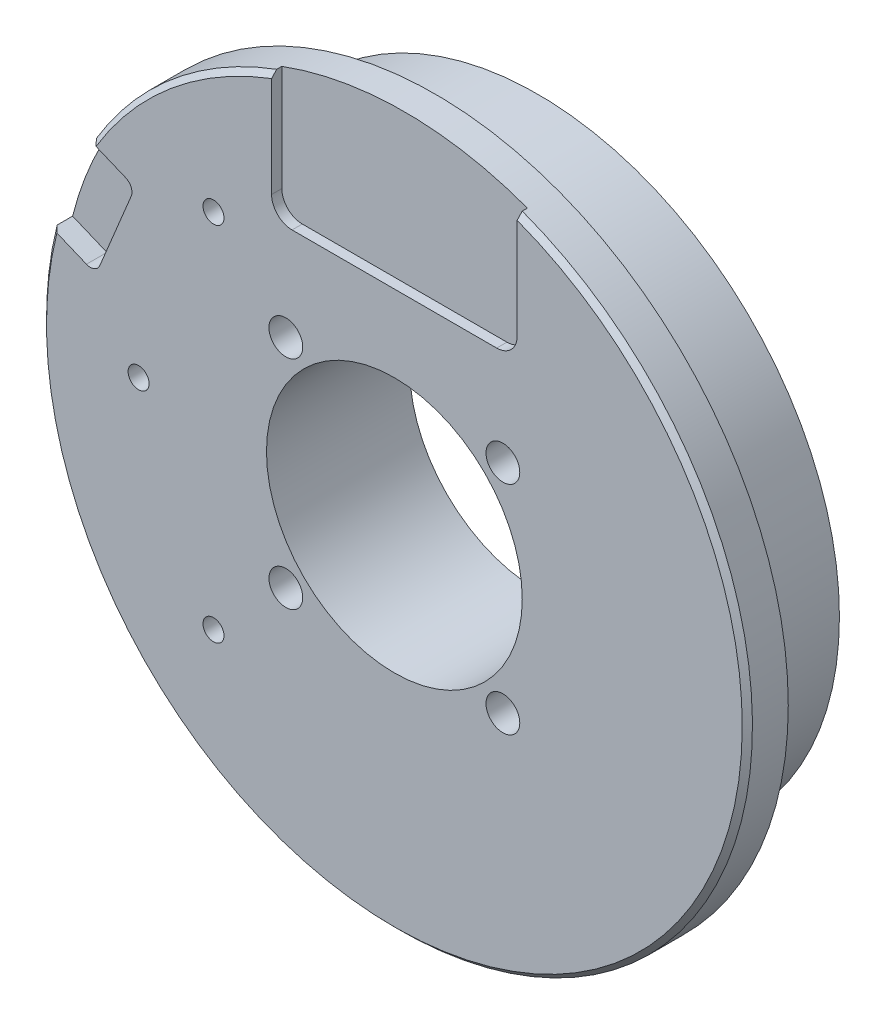
ISO-10303-21;
HEADER;
FILE_DESCRIPTION(('STEP AP214'),'2;1');
FILE_NAME('part.step','',(''),(''),'','','');
FILE_SCHEMA(('AUTOMOTIVE_DESIGN { 1 0 10303 214 1 1 1 1 }'));
ENDSEC;
DATA;
#1=APPLICATION_CONTEXT('core data for automotive mechanical design processes');
#2=APPLICATION_PROTOCOL_DEFINITION('international standard','automotive_design',2000,#1);
#3=PRODUCT_CONTEXT('',#1,'mechanical');
#4=PRODUCT('Part','Part','',(#3));
#5=PRODUCT_RELATED_PRODUCT_CATEGORY('part','',(#4));
#6=PRODUCT_DEFINITION_FORMATION('','',#4);
#7=PRODUCT_DEFINITION_CONTEXT('part definition',#1,'design');
#8=PRODUCT_DEFINITION('design','',#6,#7);
#9=PRODUCT_DEFINITION_SHAPE('','',#8);
#10=(LENGTH_UNIT() NAMED_UNIT(*) SI_UNIT(.MILLI.,.METRE.));
#11=(NAMED_UNIT(*) PLANE_ANGLE_UNIT() SI_UNIT($,.RADIAN.));
#12=(NAMED_UNIT(*) SI_UNIT($,.STERADIAN.) SOLID_ANGLE_UNIT());
#13=UNCERTAINTY_MEASURE_WITH_UNIT(LENGTH_MEASURE(1.E-05),#10,'distance_accuracy_value','');
#14=(GEOMETRIC_REPRESENTATION_CONTEXT(3) GLOBAL_UNCERTAINTY_ASSIGNED_CONTEXT((#13)) GLOBAL_UNIT_ASSIGNED_CONTEXT((#10,
#11,#12)) REPRESENTATION_CONTEXT('',''));
#15=CARTESIAN_POINT('',(0.,0.,0.));
#16=DIRECTION('',(0.,0.,1.));
#17=DIRECTION('',(1.,0.,0.));
#18=AXIS2_PLACEMENT_3D('',#15,#16,#17);
#19=CARTESIAN_POINT('',(0.,0.,14.));
#20=DIRECTION('',(0.,0.,-1.));
#21=DIRECTION('',(-1.,0.,0.));
#22=AXIS2_PLACEMENT_3D('',#19,#20,#21);
#23=CONICAL_SURFACE('',#22,34.,0.785398163397455);
#24=CARTESIAN_POINT('',(12.,20.3701050144087,24.3580631441067));
#25=CARTESIAN_POINT('',(12.,20.8510257641499,23.9436532870949));
#26=CARTESIAN_POINT('',(12.,21.3301158373592,23.5271292527835));
#27=CARTESIAN_POINT('',(12.,22.2851127258477,22.6904625830068));
#28=CARTESIAN_POINT('',(12.,22.761019595021,22.2703200090831));
#29=CARTESIAN_POINT('',(12.,23.7101150898162,21.4270380033852));
#30=CARTESIAN_POINT('',(12.,24.1833038818656,21.0038987587169));
#31=CARTESIAN_POINT('',(12.,25.1273642857462,20.1550400267585));
#32=CARTESIAN_POINT('',(12.,25.5982358862306,19.7293205268561));
#33=CARTESIAN_POINT('',(12.,27.007704540796,18.44900624832));
#34=CARTESIAN_POINT('',(12.,27.9433100887828,17.5911178367607));
#35=CARTESIAN_POINT('',(12.,29.8084621001592,15.8687575159984));
#36=CARTESIAN_POINT('',(12.,30.7380084504316,15.0042854845375));
#37=CARTESIAN_POINT('',(12.,32.5922293768415,13.2703941157218));
#38=CARTESIAN_POINT('',(12.,33.5169046145411,12.4009754853828));
#39=CARTESIAN_POINT('',(12.,35.3624825515551,10.658158216124));
#40=CARTESIAN_POINT('',(12.,36.283385275592,9.78475960336574));
#41=CARTESIAN_POINT('',(12.,38.122301169529,8.03464065922348));
#42=CARTESIAN_POINT('',(12.,39.0403138659242,7.15791983059604));
#43=CARTESIAN_POINT('',(12.,40.8738318333564,5.40185795707337));
#44=CARTESIAN_POINT('',(12.,41.7893371021223,4.5225169098064));
#45=CARTESIAN_POINT('',(12.,42.7038511233784,3.64214950239749));
#46=B_SPLINE_CURVE_WITH_KNOTS('',3,(#24,#25,#26,#27,#28,#29,#30,#31,#32,#33,#34,#35,#36,#37,#38,
#39,#40,#41,#42,#43,#44,#45),.UNSPECIFIED.,.F.,.F.,(4,2,2,2,2,2,2,2,2,2,4),(0.,1.90450046408245,
3.8089686014117,5.71331885815735,7.61767843096836,11.425776107933,15.2339446746117,
19.0415819696277,22.8491942718828,26.6574009491694,30.4656110745797),.UNSPECIFIED.);
#47=CARTESIAN_POINT('',(12.,31.8119474411737,14.));
#48=VERTEX_POINT('',#47);
#49=CARTESIAN_POINT('',(12.,32.3457879792717,13.5));
#50=VERTEX_POINT('',#49);
#51=EDGE_CURVE('E11',#48,#50,#46,.T.);
#52=ORIENTED_EDGE('',*,*,#51,.F.);
#53=CARTESIAN_POINT('',(0.,0.,14.));
#54=DIRECTION('',(0.,0.,1.));
#55=DIRECTION('',(1.,0.,0.));
#56=AXIS2_PLACEMENT_3D('',#53,#54,#55);
#57=CIRCLE('',#56,34.);
#58=CARTESIAN_POINT('',(-32.9838031388453,8.25037759729192,14.));
#59=VERTEX_POINT('',#58);
#60=EDGE_CURVE('E338',#59,#48,#57,.T.);
#61=ORIENTED_EDGE('',*,*,#60,.F.);
#62=CARTESIAN_POINT('',(-33.4509324009775,8.44386887304839,13.4998));
#63=CARTESIAN_POINT('',(-33.3730525179315,8.41160996925473,13.5832067052391));
#64=CARTESIAN_POINT('',(-33.2951695706538,8.37934979621471,13.6666100578582));
#65=CARTESIAN_POINT('',(-33.1393975476329,8.31482691164117,13.8334100578582));
#66=CARTESIAN_POINT('',(-33.0615084718898,8.28256420010765,13.9168067052391));
#67=CARTESIAN_POINT('',(-32.9836163319148,8.25030021932777,14.0002));
#68=B_SPLINE_CURVE_WITH_KNOTS('',3,(#62,#63,#64,#65,#66,#67),.UNSPECIFIED.,.F.,.F.,(4,2,4),(0.,
0.355757393772891,0.711514787553999),.UNSPECIFIED.);
#69=CARTESIAN_POINT('',(-33.4507456534528,8.44379151969096,13.5));
#70=VERTEX_POINT('',#69);
#71=EDGE_CURVE('E344',#70,#59,#68,.T.);
#72=ORIENTED_EDGE('',*,*,#71,.F.);
#73=CARTESIAN_POINT('',(0.,0.,13.5));
#74=DIRECTION('',(0.,0.,1.));
#75=DIRECTION('',(1.,0.,0.));
#76=AXIS2_PLACEMENT_3D('',#73,#74,#75);
#77=CIRCLE('',#76,34.5);
#78=EDGE_CURVE('E75',#50,#70,#77,.F.);
#79=ORIENTED_EDGE('',*,*,#78,.F.);
#80=EDGE_LOOP('',(#52,#61,#72,#79));
#81=FACE_BOUND('',#80,.T.);
#82=ADVANCED_FACE('F45',(#81),#23,.T.);
#83=CARTESIAN_POINT('',(0.,0.,10.));
#84=DIRECTION('',(0.,0.,-1.));
#85=DIRECTION('',(-1.,0.,0.));
#86=AXIS2_PLACEMENT_3D('',#83,#84,#85);
#87=CYLINDRICAL_SURFACE('',#86,29.5);
#88=CARTESIAN_POINT('',(0.,0.,10.));
#89=DIRECTION('',(0.,0.,1.));
#90=DIRECTION('',(1.,0.,0.));
#91=AXIS2_PLACEMENT_3D('',#88,#89,#90);
#92=CIRCLE('',#91,29.5);
#93=CARTESIAN_POINT('',(29.5,0.,10.));
#94=VERTEX_POINT('',#93);
#95=EDGE_CURVE('E330',#94,#94,#92,.T.);
#96=ORIENTED_EDGE('',*,*,#95,.F.);
#97=EDGE_LOOP('',(#96));
#98=FACE_BOUND('',#97,.T.);
#99=CARTESIAN_POINT('',(0.,0.,0.));
#100=DIRECTION('',(0.,0.,1.));
#101=DIRECTION('',(1.,0.,0.));
#102=AXIS2_PLACEMENT_3D('',#99,#100,#101);
#103=CIRCLE('',#102,29.5);
#104=CARTESIAN_POINT('',(29.5,0.,0.));
#105=VERTEX_POINT('',#104);
#106=EDGE_CURVE('E329',#105,#105,#103,.T.);
#107=ORIENTED_EDGE('',*,*,#106,.T.);
#108=EDGE_LOOP('',(#107));
#109=FACE_BOUND('',#108,.T.);
#110=ADVANCED_FACE('F423',(#98,#109),#87,.T.);
#111=CARTESIAN_POINT('',(0.,0.,0.));
#112=DIRECTION('',(0.,0.,1.));
#113=DIRECTION('',(1.,0.,0.));
#114=AXIS2_PLACEMENT_3D('',#111,#112,#113);
#115=PLANE('',#114);
#116=CARTESIAN_POINT('',(-10.6066017177982,10.6066017177982,0.));
#117=DIRECTION('',(0.,0.,1.));
#118=DIRECTION('',(1.,0.,0.));
#119=AXIS2_PLACEMENT_3D('',#116,#117,#118);
#120=CIRCLE('',#119,1.65);
#121=CARTESIAN_POINT('',(-8.95660171779821,10.6066017177982,0.));
#122=VERTEX_POINT('',#121);
#123=EDGE_CURVE('E289',#122,#122,#120,.T.);
#124=ORIENTED_EDGE('',*,*,#123,.T.);
#125=EDGE_LOOP('',(#124));
#126=FACE_BOUND('',#125,.T.);
#127=CARTESIAN_POINT('',(10.6066017177982,10.6066017177982,0.));
#128=DIRECTION('',(0.,0.,1.));
#129=DIRECTION('',(1.,0.,0.));
#130=AXIS2_PLACEMENT_3D('',#127,#128,#129);
#131=CIRCLE('',#130,1.65);
#132=CARTESIAN_POINT('',(12.2566017177982,10.6066017177982,0.));
#133=VERTEX_POINT('',#132);
#134=EDGE_CURVE('E297',#133,#133,#131,.T.);
#135=ORIENTED_EDGE('',*,*,#134,.T.);
#136=EDGE_LOOP('',(#135));
#137=FACE_BOUND('',#136,.T.);
#138=CARTESIAN_POINT('',(10.6066017177982,-10.6066017177982,0.));
#139=DIRECTION('',(0.,0.,1.));
#140=DIRECTION('',(1.,0.,0.));
#141=AXIS2_PLACEMENT_3D('',#138,#139,#140);
#142=CIRCLE('',#141,1.65);
#143=CARTESIAN_POINT('',(12.2566017177982,-10.6066017177982,0.));
#144=VERTEX_POINT('',#143);
#145=EDGE_CURVE('E305',#144,#144,#142,.T.);
#146=ORIENTED_EDGE('',*,*,#145,.T.);
#147=EDGE_LOOP('',(#146));
#148=FACE_BOUND('',#147,.T.);
#149=CARTESIAN_POINT('',(-10.6066017177982,-10.6066017177982,0.));
#150=DIRECTION('',(0.,0.,1.));
#151=DIRECTION('',(1.,0.,0.));
#152=AXIS2_PLACEMENT_3D('',#149,#150,#151);
#153=CIRCLE('',#152,1.65);
#154=CARTESIAN_POINT('',(-8.95660171779821,-10.6066017177982,0.));
#155=VERTEX_POINT('',#154);
#156=EDGE_CURVE('E313',#155,#155,#153,.T.);
#157=ORIENTED_EDGE('',*,*,#156,.T.);
#158=EDGE_LOOP('',(#157));
#159=FACE_BOUND('',#158,.T.);
#160=CARTESIAN_POINT('',(0.,0.,0.));
#161=DIRECTION('',(0.,0.,1.));
#162=DIRECTION('',(1.,0.,0.));
#163=AXIS2_PLACEMENT_3D('',#160,#161,#162);
#164=CIRCLE('',#163,12.5);
#165=CARTESIAN_POINT('',(12.5,0.,0.));
#166=VERTEX_POINT('',#165);
#167=EDGE_CURVE('E318',#166,#166,#164,.T.);
#168=ORIENTED_EDGE('',*,*,#167,.T.);
#169=EDGE_LOOP('',(#168));
#170=FACE_BOUND('',#169,.T.);
#171=ORIENTED_EDGE('',*,*,#106,.F.);
#172=EDGE_LOOP('',(#171));
#173=FACE_BOUND('',#172,.T.);
#174=ADVANCED_FACE('F421',(#126,#137,#148,#159,#170,#173),#115,.F.);
#175=CARTESIAN_POINT('',(0.,0.,14.));
#176=DIRECTION('',(0.,0.,-1.));
#177=DIRECTION('',(-1.,0.,0.));
#178=AXIS2_PLACEMENT_3D('',#175,#176,#177);
#179=CYLINDRICAL_SURFACE('',#178,34.5);
#180=CARTESIAN_POINT('',(0.,0.,13.));
#181=DIRECTION('',(0.,0.,1.));
#182=DIRECTION('',(1.,0.,0.));
#183=AXIS2_PLACEMENT_3D('',#180,#181,#182);
#184=CIRCLE('',#183,34.5);
#185=CARTESIAN_POINT('',(12.,32.3457879792717,13.));
#186=VERTEX_POINT('',#185);
#187=CARTESIAN_POINT('',(-12.,32.3457879792717,13.));
#188=VERTEX_POINT('',#187);
#189=EDGE_CURVE('E171',#186,#188,#184,.T.);
#190=ORIENTED_EDGE('',*,*,#189,.F.);
#191=DIRECTION('',(0.,0.,1.));
#192=VECTOR('',#191,1.);
#193=CARTESIAN_POINT('',(12.,32.3457879792717,13.));
#194=LINE('',#193,#192);
#195=EDGE_CURVE('E228',#186,#50,#194,.T.);
#196=ORIENTED_EDGE('',*,*,#195,.T.);
#197=ORIENTED_EDGE('',*,*,#78,.T.);
#198=DIRECTION('',(0.,0.,1.));
#199=VECTOR('',#198,1.);
#200=CARTESIAN_POINT('',(-33.4507456534528,8.44379151969095,12.));
#201=LINE('',#200,#199);
#202=CARTESIAN_POINT('',(-33.4507456534528,8.44379151969095,12.));
#203=VERTEX_POINT('',#202);
#204=EDGE_CURVE('E223',#203,#70,#201,.T.);
#205=ORIENTED_EDGE('',*,*,#204,.F.);
#206=CARTESIAN_POINT('',(0.,0.,12.));
#207=DIRECTION('',(0.,0.,1.));
#208=DIRECTION('',(1.,0.,0.));
#209=AXIS2_PLACEMENT_3D('',#206,#207,#208);
#210=CIRCLE('',#209,34.5);
#211=CARTESIAN_POINT('',(-29.623911329802,17.6825868448038,12.));
#212=VERTEX_POINT('',#211);
#213=EDGE_CURVE('E198',#212,#203,#210,.T.);
#214=ORIENTED_EDGE('',*,*,#213,.F.);
#215=DIRECTION('',(0.,0.,1.));
#216=VECTOR('',#215,1.);
#217=CARTESIAN_POINT('',(-29.623911329802,17.6825868448038,12.));
#218=LINE('',#217,#216);
#219=CARTESIAN_POINT('',(-29.623911329802,17.6825868448038,13.5));
#220=VERTEX_POINT('',#219);
#221=EDGE_CURVE('E243',#212,#220,#218,.T.);
#222=ORIENTED_EDGE('',*,*,#221,.T.);
#223=CARTESIAN_POINT('',(-12.,32.3457879792717,13.5));
#224=VERTEX_POINT('',#223);
#225=EDGE_CURVE('E187',#220,#224,#77,.F.);
#226=ORIENTED_EDGE('',*,*,#225,.T.);
#227=DIRECTION('',(0.,0.,1.));
#228=VECTOR('',#227,1.);
#229=CARTESIAN_POINT('',(-12.,32.3457879792717,13.));
#230=LINE('',#229,#228);
#231=EDGE_CURVE('E67',#188,#224,#230,.T.);
#232=ORIENTED_EDGE('',*,*,#231,.F.);
#233=EDGE_LOOP('',(#190,#196,#197,#205,#214,#222,#226,#232));
#234=FACE_BOUND('',#233,.T.);
#235=CARTESIAN_POINT('',(0.,0.,10.));
#236=DIRECTION('',(0.,0.,1.));
#237=DIRECTION('',(1.,0.,0.));
#238=AXIS2_PLACEMENT_3D('',#235,#236,#237);
#239=CIRCLE('',#238,34.5);
#240=CARTESIAN_POINT('',(34.5,0.,10.));
#241=VERTEX_POINT('',#240);
#242=EDGE_CURVE('E322',#241,#241,#239,.T.);
#243=ORIENTED_EDGE('',*,*,#242,.T.);
#244=EDGE_LOOP('',(#243));
#245=FACE_BOUND('',#244,.T.);
#246=ADVANCED_FACE('F183',(#234,#245),#179,.T.);
#247=CARTESIAN_POINT('',(0.,0.,14.));
#248=DIRECTION('',(0.,0.,1.));
#249=DIRECTION('',(1.,0.,0.));
#250=AXIS2_PLACEMENT_3D('',#247,#248,#249);
#251=PLANE('',#250);
#252=DIRECTION('',(0.,1.,0.));
#253=VECTOR('',#252,1.);
#254=CARTESIAN_POINT('',(12.,22.,14.));
#255=LINE('',#254,#253);
#256=CARTESIAN_POINT('',(12.,22.,14.));
#257=VERTEX_POINT('',#256);
#258=EDGE_CURVE('E180',#257,#48,#255,.T.);
#259=ORIENTED_EDGE('',*,*,#258,.F.);
#260=CARTESIAN_POINT('',(9.99999999999999,22.,14.));
#261=DIRECTION('',(0.,0.,1.));
#262=DIRECTION('',(1.,0.,0.));
#263=AXIS2_PLACEMENT_3D('',#260,#261,#262);
#264=CIRCLE('',#263,2.);
#265=CARTESIAN_POINT('',(9.99999999999999,20.,14.));
#266=VERTEX_POINT('',#265);
#267=EDGE_CURVE('E521',#266,#257,#264,.T.);
#268=ORIENTED_EDGE('',*,*,#267,.F.);
#269=DIRECTION('',(1.,0.,0.));
#270=VECTOR('',#269,1.);
#271=CARTESIAN_POINT('',(-10.,20.,14.));
#272=LINE('',#271,#270);
#273=CARTESIAN_POINT('',(-10.,20.,14.));
#274=VERTEX_POINT('',#273);
#275=EDGE_CURVE('E510',#274,#266,#272,.T.);
#276=ORIENTED_EDGE('',*,*,#275,.F.);
#277=CARTESIAN_POINT('',(-10.,22.,14.));
#278=DIRECTION('',(0.,0.,1.));
#279=DIRECTION('',(1.,0.,0.));
#280=AXIS2_PLACEMENT_3D('',#277,#278,#279);
#281=CIRCLE('',#280,2.);
#282=CARTESIAN_POINT('',(-12.,22.,14.));
#283=VERTEX_POINT('',#282);
#284=EDGE_CURVE('E516',#283,#274,#281,.T.);
#285=ORIENTED_EDGE('',*,*,#284,.F.);
#286=DIRECTION('',(0.,-1.,0.));
#287=VECTOR('',#286,1.);
#288=CARTESIAN_POINT('',(-12.,32.3457879792717,14.));
#289=LINE('',#288,#287);
#290=CARTESIAN_POINT('',(-12.,31.8119474411737,14.));
#291=VERTEX_POINT('',#290);
#292=EDGE_CURVE('E518',#291,#283,#289,.T.);
#293=ORIENTED_EDGE('',*,*,#292,.F.);
#294=CARTESIAN_POINT('',(-29.1569688151944,17.4891729224048,14.));
#295=VERTEX_POINT('',#294);
#296=EDGE_CURVE('E334',#291,#295,#57,.T.);
#297=ORIENTED_EDGE('',*,*,#296,.T.);
#298=DIRECTION('',(-0.923879532511289,0.382683432365085,0.));
#299=VECTOR('',#298,1.);
#300=CARTESIAN_POINT('',(-26.2649085797688,16.2912423496916,14.));
#301=LINE('',#300,#299);
#302=CARTESIAN_POINT('',(-26.2649085797688,16.2912423496916,14.));
#303=VERTEX_POINT('',#302);
#304=EDGE_CURVE('E203',#303,#295,#301,.T.);
#305=ORIENTED_EDGE('',*,*,#304,.F.);
#306=CARTESIAN_POINT('',(-26.6475920121339,15.3673628171803,14.));
#307=DIRECTION('',(0.,0.,1.));
#308=DIRECTION('',(1.,0.,0.));
#309=AXIS2_PLACEMENT_3D('',#306,#307,#308);
#310=CIRCLE('',#309,1.);
#311=CARTESIAN_POINT('',(-25.7237124796226,14.9846793848152,14.));
#312=VERTEX_POINT('',#311);
#313=EDGE_CURVE('E236',#312,#303,#310,.T.);
#314=ORIENTED_EDGE('',*,*,#313,.F.);
#315=DIRECTION('',(0.382683432365087,0.923879532511288,0.));
#316=VECTOR('',#315,1.);
#317=CARTESIAN_POINT('',(-28.7851799385433,7.59364312472491,14.));
#318=LINE('',#317,#316);
#319=CARTESIAN_POINT('',(-28.7851799385433,7.59364312472491,14.));
#320=VERTEX_POINT('',#319);
#321=EDGE_CURVE('E232',#320,#312,#318,.T.);
#322=ORIENTED_EDGE('',*,*,#321,.F.);
#323=CARTESIAN_POINT('',(-29.7090594710546,7.97632655709,14.));
#324=DIRECTION('',(0.,0.,1.));
#325=DIRECTION('',(1.,0.,0.));
#326=AXIS2_PLACEMENT_3D('',#323,#324,#325);
#327=CIRCLE('',#326,1.);
#328=CARTESIAN_POINT('',(-30.0917429034197,7.05244702457871,14.));
#329=VERTEX_POINT('',#328);
#330=EDGE_CURVE('E227',#329,#320,#327,.T.);
#331=ORIENTED_EDGE('',*,*,#330,.F.);
#332=DIRECTION('',(0.923879532511287,-0.38268343236509,0.));
#333=VECTOR('',#332,1.);
#334=CARTESIAN_POINT('',(-33.4507456534528,8.44379151969095,14.));
#335=LINE('',#334,#333);
#336=EDGE_CURVE('E224',#59,#329,#335,.T.);
#337=ORIENTED_EDGE('',*,*,#336,.F.);
#338=ORIENTED_EDGE('',*,*,#60,.T.);
#339=EDGE_LOOP('',(#259,#268,#276,#285,#293,#297,#305,#314,#322,#331,#337,#338));
#340=FACE_BOUND('',#339,.T.);
#341=CARTESIAN_POINT('',(-17.6776695296638,-17.6776695296636,14.));
#342=DIRECTION('',(0.,0.,1.));
#343=DIRECTION('',(1.,0.,0.));
#344=AXIS2_PLACEMENT_3D('',#341,#342,#343);
#345=CIRCLE('',#344,1.025);
#346=CARTESIAN_POINT('',(-16.6526695296638,-17.6776695296636,14.));
#347=VERTEX_POINT('',#346);
#348=EDGE_CURVE('E246',#347,#347,#345,.T.);
#349=ORIENTED_EDGE('',*,*,#348,.F.);
#350=EDGE_LOOP('',(#349));
#351=FACE_BOUND('',#350,.T.);
#352=CARTESIAN_POINT('',(-25.,0.,14.));
#353=DIRECTION('',(0.,0.,1.));
#354=DIRECTION('',(1.,0.,0.));
#355=AXIS2_PLACEMENT_3D('',#352,#353,#354);
#356=CIRCLE('',#355,1.025);
#357=CARTESIAN_POINT('',(-23.975,0.,14.));
#358=VERTEX_POINT('',#357);
#359=EDGE_CURVE('E269',#358,#358,#356,.T.);
#360=ORIENTED_EDGE('',*,*,#359,.F.);
#361=EDGE_LOOP('',(#360));
#362=FACE_BOUND('',#361,.T.);
#363=CARTESIAN_POINT('',(-17.6776695296638,17.6776695296636,14.));
#364=DIRECTION('',(0.,0.,1.));
#365=DIRECTION('',(1.,0.,0.));
#366=AXIS2_PLACEMENT_3D('',#363,#364,#365);
#367=CIRCLE('',#366,1.025);
#368=CARTESIAN_POINT('',(-16.6526695296638,17.6776695296636,14.));
#369=VERTEX_POINT('',#368);
#370=EDGE_CURVE('E277',#369,#369,#367,.T.);
#371=ORIENTED_EDGE('',*,*,#370,.F.);
#372=EDGE_LOOP('',(#371));
#373=FACE_BOUND('',#372,.T.);
#374=CARTESIAN_POINT('',(-10.6066017177982,10.6066017177982,14.));
#375=DIRECTION('',(0.,0.,1.));
#376=DIRECTION('',(1.,0.,0.));
#377=AXIS2_PLACEMENT_3D('',#374,#375,#376);
#378=CIRCLE('',#377,1.65);
#379=CARTESIAN_POINT('',(-8.95660171779821,10.6066017177982,14.));
#380=VERTEX_POINT('',#379);
#381=EDGE_CURVE('E285',#380,#380,#378,.T.);
#382=ORIENTED_EDGE('',*,*,#381,.F.);
#383=EDGE_LOOP('',(#382));
#384=FACE_BOUND('',#383,.T.);
#385=CARTESIAN_POINT('',(10.6066017177982,10.6066017177982,14.));
#386=DIRECTION('',(0.,0.,1.));
#387=DIRECTION('',(1.,0.,0.));
#388=AXIS2_PLACEMENT_3D('',#385,#386,#387);
#389=CIRCLE('',#388,1.65);
#390=CARTESIAN_POINT('',(12.2566017177982,10.6066017177982,14.));
#391=VERTEX_POINT('',#390);
#392=EDGE_CURVE('E293',#391,#391,#389,.T.);
#393=ORIENTED_EDGE('',*,*,#392,.F.);
#394=EDGE_LOOP('',(#393));
#395=FACE_BOUND('',#394,.T.);
#396=CARTESIAN_POINT('',(10.6066017177982,-10.6066017177982,14.));
#397=DIRECTION('',(0.,0.,1.));
#398=DIRECTION('',(1.,0.,0.));
#399=AXIS2_PLACEMENT_3D('',#396,#397,#398);
#400=CIRCLE('',#399,1.65);
#401=CARTESIAN_POINT('',(12.2566017177982,-10.6066017177982,14.));
#402=VERTEX_POINT('',#401);
#403=EDGE_CURVE('E301',#402,#402,#400,.T.);
#404=ORIENTED_EDGE('',*,*,#403,.F.);
#405=EDGE_LOOP('',(#404));
#406=FACE_BOUND('',#405,.T.);
#407=CARTESIAN_POINT('',(-10.6066017177982,-10.6066017177982,14.));
#408=DIRECTION('',(0.,0.,1.));
#409=DIRECTION('',(1.,0.,0.));
#410=AXIS2_PLACEMENT_3D('',#407,#408,#409);
#411=CIRCLE('',#410,1.65);
#412=CARTESIAN_POINT('',(-8.95660171779821,-10.6066017177982,14.));
#413=VERTEX_POINT('',#412);
#414=EDGE_CURVE('E309',#413,#413,#411,.T.);
#415=ORIENTED_EDGE('',*,*,#414,.F.);
#416=EDGE_LOOP('',(#415));
#417=FACE_BOUND('',#416,.T.);
#418=CARTESIAN_POINT('',(0.,0.,14.));
#419=DIRECTION('',(0.,0.,1.));
#420=DIRECTION('',(1.,0.,0.));
#421=AXIS2_PLACEMENT_3D('',#418,#419,#420);
#422=CIRCLE('',#421,12.5);
#423=CARTESIAN_POINT('',(12.5,0.,14.));
#424=VERTEX_POINT('',#423);
#425=EDGE_CURVE('E317',#424,#424,#422,.T.);
#426=ORIENTED_EDGE('',*,*,#425,.F.);
#427=EDGE_LOOP('',(#426));
#428=FACE_BOUND('',#427,.T.);
#429=ADVANCED_FACE('F412',(#340,#351,#362,#373,#384,#395,#406,#417,#428),#251,.T.);
#430=CARTESIAN_POINT('',(0.,0.,10.));
#431=DIRECTION('',(0.,0.,1.));
#432=DIRECTION('',(1.,0.,0.));
#433=AXIS2_PLACEMENT_3D('',#430,#431,#432);
#434=PLANE('',#433);
#435=ORIENTED_EDGE('',*,*,#95,.T.);
#436=EDGE_LOOP('',(#435));
#437=FACE_BOUND('',#436,.T.);
#438=ORIENTED_EDGE('',*,*,#242,.F.);
#439=EDGE_LOOP('',(#438));
#440=FACE_BOUND('',#439,.T.);
#441=ADVANCED_FACE('F410',(#437,#440),#434,.F.);
#442=CARTESIAN_POINT('',(0.,0.,0.));
#443=DIRECTION('',(0.,0.,1.));
#444=DIRECTION('',(1.,0.,0.));
#445=AXIS2_PLACEMENT_3D('',#442,#443,#444);
#446=CYLINDRICAL_SURFACE('',#445,12.5);
#447=ORIENTED_EDGE('',*,*,#167,.F.);
#448=EDGE_LOOP('',(#447));
#449=FACE_BOUND('',#448,.T.);
#450=ORIENTED_EDGE('',*,*,#425,.T.);
#451=EDGE_LOOP('',(#450));
#452=FACE_BOUND('',#451,.T.);
#453=ADVANCED_FACE('F406',(#449,#452),#446,.F.);
#454=CARTESIAN_POINT('',(-10.6066017177982,-10.6066017177982,14.));
#455=DIRECTION('',(0.,0.,1.));
#456=DIRECTION('',(1.,0.,0.));
#457=AXIS2_PLACEMENT_3D('',#454,#455,#456);
#458=CYLINDRICAL_SURFACE('',#457,1.65);
#459=ORIENTED_EDGE('',*,*,#156,.F.);
#460=EDGE_LOOP('',(#459));
#461=FACE_BOUND('',#460,.T.);
#462=ORIENTED_EDGE('',*,*,#414,.T.);
#463=EDGE_LOOP('',(#462));
#464=FACE_BOUND('',#463,.T.);
#465=ADVANCED_FACE('F402',(#461,#464),#458,.F.);
#466=CARTESIAN_POINT('',(10.6066017177982,-10.6066017177982,14.));
#467=DIRECTION('',(0.,0.,1.));
#468=DIRECTION('',(1.,0.,0.));
#469=AXIS2_PLACEMENT_3D('',#466,#467,#468);
#470=CYLINDRICAL_SURFACE('',#469,1.65);
#471=ORIENTED_EDGE('',*,*,#145,.F.);
#472=EDGE_LOOP('',(#471));
#473=FACE_BOUND('',#472,.T.);
#474=ORIENTED_EDGE('',*,*,#403,.T.);
#475=EDGE_LOOP('',(#474));
#476=FACE_BOUND('',#475,.T.);
#477=ADVANCED_FACE('F398',(#473,#476),#470,.F.);
#478=CARTESIAN_POINT('',(10.6066017177982,10.6066017177982,14.));
#479=DIRECTION('',(0.,0.,1.));
#480=DIRECTION('',(1.,0.,0.));
#481=AXIS2_PLACEMENT_3D('',#478,#479,#480);
#482=CYLINDRICAL_SURFACE('',#481,1.65);
#483=ORIENTED_EDGE('',*,*,#134,.F.);
#484=EDGE_LOOP('',(#483));
#485=FACE_BOUND('',#484,.T.);
#486=ORIENTED_EDGE('',*,*,#392,.T.);
#487=EDGE_LOOP('',(#486));
#488=FACE_BOUND('',#487,.T.);
#489=ADVANCED_FACE('F394',(#485,#488),#482,.F.);
#490=CARTESIAN_POINT('',(-10.6066017177982,10.6066017177982,14.));
#491=DIRECTION('',(0.,0.,1.));
#492=DIRECTION('',(1.,0.,0.));
#493=AXIS2_PLACEMENT_3D('',#490,#491,#492);
#494=CYLINDRICAL_SURFACE('',#493,1.65);
#495=ORIENTED_EDGE('',*,*,#123,.F.);
#496=EDGE_LOOP('',(#495));
#497=FACE_BOUND('',#496,.T.);
#498=ORIENTED_EDGE('',*,*,#381,.T.);
#499=EDGE_LOOP('',(#498));
#500=FACE_BOUND('',#499,.T.);
#501=ADVANCED_FACE('F390',(#497,#500),#494,.F.);
#502=CARTESIAN_POINT('',(-17.6776695296638,17.6776695296636,7.65));
#503=DIRECTION('',(0.,0.,1.));
#504=DIRECTION('',(1.,0.,0.));
#505=AXIS2_PLACEMENT_3D('',#502,#503,#504);
#506=CONICAL_SURFACE('',#505,1.025,1.02974425867665);
#507=CARTESIAN_POINT('',(-17.6776695296638,17.6776695296636,7.03411786549675));
#508=VERTEX_POINT('',#507);
#509=VERTEX_LOOP('',#508);
#510=FACE_BOUND('',#509,.T.);
#511=CARTESIAN_POINT('',(-17.6776695296638,17.6776695296636,7.65));
#512=DIRECTION('',(0.,0.,1.));
#513=DIRECTION('',(1.,0.,0.));
#514=AXIS2_PLACEMENT_3D('',#511,#512,#513);
#515=CIRCLE('',#514,1.025);
#516=CARTESIAN_POINT('',(-16.6526695296638,17.6776695296636,7.65));
#517=VERTEX_POINT('',#516);
#518=EDGE_CURVE('E281',#517,#517,#515,.T.);
#519=ORIENTED_EDGE('',*,*,#518,.T.);
#520=EDGE_LOOP('',(#519));
#521=FACE_BOUND('',#520,.T.);
#522=ADVANCED_FACE('F386',(#510,#521),#506,.F.);
#523=CARTESIAN_POINT('',(-17.6776695296638,17.6776695296636,14.));
#524=DIRECTION('',(0.,0.,1.));
#525=DIRECTION('',(1.,0.,0.));
#526=AXIS2_PLACEMENT_3D('',#523,#524,#525);
#527=CYLINDRICAL_SURFACE('',#526,1.025);
#528=ORIENTED_EDGE('',*,*,#518,.F.);
#529=EDGE_LOOP('',(#528));
#530=FACE_BOUND('',#529,.T.);
#531=ORIENTED_EDGE('',*,*,#370,.T.);
#532=EDGE_LOOP('',(#531));
#533=FACE_BOUND('',#532,.T.);
#534=ADVANCED_FACE('F382',(#530,#533),#527,.F.);
#535=CARTESIAN_POINT('',(-25.,0.,7.65));
#536=DIRECTION('',(0.,0.,1.));
#537=DIRECTION('',(1.,0.,0.));
#538=AXIS2_PLACEMENT_3D('',#535,#536,#537);
#539=CONICAL_SURFACE('',#538,1.025,1.02974425867665);
#540=CARTESIAN_POINT('',(-25.,0.,7.03411786549675));
#541=VERTEX_POINT('',#540);
#542=VERTEX_LOOP('',#541);
#543=FACE_BOUND('',#542,.T.);
#544=CARTESIAN_POINT('',(-25.,0.,7.65));
#545=DIRECTION('',(0.,0.,1.));
#546=DIRECTION('',(1.,0.,0.));
#547=AXIS2_PLACEMENT_3D('',#544,#545,#546);
#548=CIRCLE('',#547,1.025);
#549=CARTESIAN_POINT('',(-23.975,0.,7.65));
#550=VERTEX_POINT('',#549);
#551=EDGE_CURVE('E273',#550,#550,#548,.T.);
#552=ORIENTED_EDGE('',*,*,#551,.T.);
#553=EDGE_LOOP('',(#552));
#554=FACE_BOUND('',#553,.T.);
#555=ADVANCED_FACE('F378',(#543,#554),#539,.F.);
#556=CARTESIAN_POINT('',(-25.,0.,14.));
#557=DIRECTION('',(0.,0.,1.));
#558=DIRECTION('',(1.,0.,0.));
#559=AXIS2_PLACEMENT_3D('',#556,#557,#558);
#560=CYLINDRICAL_SURFACE('',#559,1.025);
#561=ORIENTED_EDGE('',*,*,#551,.F.);
#562=EDGE_LOOP('',(#561));
#563=FACE_BOUND('',#562,.T.);
#564=ORIENTED_EDGE('',*,*,#359,.T.);
#565=EDGE_LOOP('',(#564));
#566=FACE_BOUND('',#565,.T.);
#567=ADVANCED_FACE('F374',(#563,#566),#560,.F.);
#568=CARTESIAN_POINT('',(-17.6776695296638,-17.6776695296636,7.65));
#569=DIRECTION('',(0.,0.,1.));
#570=DIRECTION('',(1.,0.,0.));
#571=AXIS2_PLACEMENT_3D('',#568,#569,#570);
#572=CONICAL_SURFACE('',#571,1.025,1.02974425867665);
#573=CARTESIAN_POINT('',(-17.6776695296638,-17.6776695296636,7.03411786549675));
#574=VERTEX_POINT('',#573);
#575=VERTEX_LOOP('',#574);
#576=FACE_BOUND('',#575,.T.);
#577=CARTESIAN_POINT('',(-17.6776695296638,-17.6776695296636,7.65));
#578=DIRECTION('',(0.,0.,1.));
#579=DIRECTION('',(1.,0.,0.));
#580=AXIS2_PLACEMENT_3D('',#577,#578,#579);
#581=CIRCLE('',#580,1.025);
#582=CARTESIAN_POINT('',(-16.6526695296638,-17.6776695296636,7.65));
#583=VERTEX_POINT('',#582);
#584=EDGE_CURVE('E265',#583,#583,#581,.T.);
#585=ORIENTED_EDGE('',*,*,#584,.T.);
#586=EDGE_LOOP('',(#585));
#587=FACE_BOUND('',#586,.T.);
#588=ADVANCED_FACE('F370',(#576,#587),#572,.F.);
#589=CARTESIAN_POINT('',(-17.6776695296638,-17.6776695296636,14.));
#590=DIRECTION('',(0.,0.,1.));
#591=DIRECTION('',(1.,0.,0.));
#592=AXIS2_PLACEMENT_3D('',#589,#590,#591);
#593=CYLINDRICAL_SURFACE('',#592,1.025);
#594=ORIENTED_EDGE('',*,*,#584,.F.);
#595=EDGE_LOOP('',(#594));
#596=FACE_BOUND('',#595,.T.);
#597=ORIENTED_EDGE('',*,*,#348,.T.);
#598=EDGE_LOOP('',(#597));
#599=FACE_BOUND('',#598,.T.);
#600=ADVANCED_FACE('F367',(#596,#599),#593,.F.);
#601=CARTESIAN_POINT('',(-12.,42.7038511233784,3.6421495023975));
#602=CARTESIAN_POINT('',(-12.,41.7893371021223,4.52251690980641));
#603=CARTESIAN_POINT('',(-12.,40.8738318333564,5.40185795707338));
#604=CARTESIAN_POINT('',(-12.,39.0403138659242,7.15791983059605));
#605=CARTESIAN_POINT('',(-12.,38.122301169529,8.03464065922349));
#606=CARTESIAN_POINT('',(-12.,36.283385275592,9.78475960336575));
#607=CARTESIAN_POINT('',(-12.,35.3624825515551,10.658158216124));
#608=CARTESIAN_POINT('',(-12.,33.5169046145411,12.4009754853828));
#609=CARTESIAN_POINT('',(-12.,32.5922293768415,13.2703941157218));
#610=CARTESIAN_POINT('',(-12.,30.7380084504316,15.0042854845375));
#611=CARTESIAN_POINT('',(-12.,29.8084621001592,15.8687575159984));
#612=CARTESIAN_POINT('',(-12.,27.9433100887828,17.5911178367607));
#613=CARTESIAN_POINT('',(-12.,27.007704540796,18.44900624832));
#614=CARTESIAN_POINT('',(-12.,25.5982358862306,19.7293205268561));
#615=CARTESIAN_POINT('',(-12.,25.1273642857462,20.1550400267585));
#616=CARTESIAN_POINT('',(-12.,24.1833038818655,21.0038987587169));
#617=CARTESIAN_POINT('',(-12.,23.7101150898162,21.4270380033852));
#618=CARTESIAN_POINT('',(-12.,22.761019595021,22.2703200090831));
#619=CARTESIAN_POINT('',(-12.,22.2851127258476,22.6904625830068));
#620=CARTESIAN_POINT('',(-12.,21.3301158373592,23.5271292527835));
#621=CARTESIAN_POINT('',(-12.,20.8510257641499,23.9436532870949));
#622=CARTESIAN_POINT('',(-12.,20.3701050144087,24.3580631441067));
#623=B_SPLINE_CURVE_WITH_KNOTS('',3,(#601,#602,#603,#604,#605,#606,#607,#608,#609,#610,#611,
#612,#613,#614,#615,#616,#617,#618,#619,#620,#621,#622),.UNSPECIFIED.,.F.,.F.,(4,2,2,2,2,2,2,2,
2,2,4),(0.,3.8082101254103,7.61641680269696,11.424029104952,15.2316663999681,19.0398349666467,
22.8479326436114,24.7522922164224,26.656642473168,28.5611106104973,30.4656110745797),.UNSPECIFIED.);
#624=EDGE_CURVE('E60',#224,#291,#623,.T.);
#625=ORIENTED_EDGE('',*,*,#624,.F.);
#626=ORIENTED_EDGE('',*,*,#225,.F.);
#627=CARTESIAN_POINT('',(-29.156782008264,17.4890955444407,14.0002));
#628=CARTESIAN_POINT('',(-29.2346741482389,17.5213595252205,13.9168067052391));
#629=CARTESIAN_POINT('',(-29.312563223982,17.5536222367541,13.8334100578582));
#630=CARTESIAN_POINT('',(-29.4683352470029,17.6181451213276,13.6666100578582));
#631=CARTESIAN_POINT('',(-29.5462181942806,17.6504052943676,13.5832067052391));
#632=CARTESIAN_POINT('',(-29.6240980773266,17.6826641981613,13.4998));
#633=B_SPLINE_CURVE_WITH_KNOTS('',3,(#627,#628,#629,#630,#631,#632),.UNSPECIFIED.,.F.,.F.,(4,2,
4),(0.,0.355757393781106,0.711514787553994),.UNSPECIFIED.);
#634=EDGE_CURVE('E352',#295,#220,#633,.T.);
#635=ORIENTED_EDGE('',*,*,#634,.F.);
#636=ORIENTED_EDGE('',*,*,#296,.F.);
#637=EDGE_LOOP('',(#625,#626,#635,#636));
#638=FACE_BOUND('',#637,.T.);
#639=ADVANCED_FACE('F47',(#638),#23,.T.);
#640=CARTESIAN_POINT('',(-26.2649085797688,16.2912423496916,12.));
#641=DIRECTION('',(0.382683432365085,0.923879532511289,0.));
#642=DIRECTION('',(-0.923879532511289,0.382683432365085,0.));
#643=AXIS2_PLACEMENT_3D('',#640,#641,#642);
#644=PLANE('',#643);
#645=ORIENTED_EDGE('',*,*,#634,.T.);
#646=ORIENTED_EDGE('',*,*,#221,.F.);
#647=DIRECTION('',(-0.923879532511289,0.382683432365085,0.));
#648=VECTOR('',#647,1.);
#649=CARTESIAN_POINT('',(-26.2649085797688,16.2912423496916,12.));
#650=LINE('',#649,#648);
#651=CARTESIAN_POINT('',(-26.2649085797688,16.2912423496916,12.));
#652=VERTEX_POINT('',#651);
#653=EDGE_CURVE('E219',#652,#212,#650,.T.);
#654=ORIENTED_EDGE('',*,*,#653,.F.);
#655=DIRECTION('',(0.,0.,1.));
#656=VECTOR('',#655,1.);
#657=CARTESIAN_POINT('',(-26.2649085797688,16.2912423496916,12.));
#658=LINE('',#657,#656);
#659=EDGE_CURVE('E247',#652,#303,#658,.T.);
#660=ORIENTED_EDGE('',*,*,#659,.T.);
#661=ORIENTED_EDGE('',*,*,#304,.T.);
#662=EDGE_LOOP('',(#645,#646,#654,#660,#661));
#663=FACE_BOUND('',#662,.T.);
#664=ADVANCED_FACE('F442',(#663),#644,.F.);
#665=CARTESIAN_POINT('',(-26.6475920121339,15.3673628171803,12.));
#666=DIRECTION('',(0.,0.,1.));
#667=DIRECTION('',(1.,0.,0.));
#668=AXIS2_PLACEMENT_3D('',#665,#666,#667);
#669=CYLINDRICAL_SURFACE('',#668,1.);
#670=ORIENTED_EDGE('',*,*,#313,.T.);
#671=ORIENTED_EDGE('',*,*,#659,.F.);
#672=CARTESIAN_POINT('',(-26.6475920121339,15.3673628171803,12.));
#673=DIRECTION('',(0.,0.,1.));
#674=DIRECTION('',(1.,0.,0.));
#675=AXIS2_PLACEMENT_3D('',#672,#673,#674);
#676=CIRCLE('',#675,1.);
#677=CARTESIAN_POINT('',(-25.7237124796226,14.9846793848152,12.));
#678=VERTEX_POINT('',#677);
#679=EDGE_CURVE('E215',#678,#652,#676,.T.);
#680=ORIENTED_EDGE('',*,*,#679,.F.);
#681=DIRECTION('',(0.,0.,1.));
#682=VECTOR('',#681,1.);
#683=CARTESIAN_POINT('',(-25.7237124796226,14.9846793848152,12.));
#684=LINE('',#683,#682);
#685=EDGE_CURVE('E250',#678,#312,#684,.T.);
#686=ORIENTED_EDGE('',*,*,#685,.T.);
#687=EDGE_LOOP('',(#670,#671,#680,#686));
#688=FACE_BOUND('',#687,.T.);
#689=ADVANCED_FACE('F447',(#688),#669,.F.);
#690=CARTESIAN_POINT('',(-28.7851799385433,7.59364312472491,12.));
#691=DIRECTION('',(0.923879532511288,-0.382683432365087,0.));
#692=DIRECTION('',(0.382683432365087,0.923879532511288,0.));
#693=AXIS2_PLACEMENT_3D('',#690,#691,#692);
#694=PLANE('',#693);
#695=ORIENTED_EDGE('',*,*,#321,.T.);
#696=ORIENTED_EDGE('',*,*,#685,.F.);
#697=DIRECTION('',(0.382683432365087,0.923879532511288,0.));
#698=VECTOR('',#697,1.);
#699=CARTESIAN_POINT('',(-28.7851799385433,7.59364312472491,12.));
#700=LINE('',#699,#698);
#701=CARTESIAN_POINT('',(-28.7851799385433,7.59364312472491,12.));
#702=VERTEX_POINT('',#701);
#703=EDGE_CURVE('E211',#702,#678,#700,.T.);
#704=ORIENTED_EDGE('',*,*,#703,.F.);
#705=DIRECTION('',(0.,0.,1.));
#706=VECTOR('',#705,1.);
#707=CARTESIAN_POINT('',(-28.7851799385433,7.59364312472491,12.));
#708=LINE('',#707,#706);
#709=EDGE_CURVE('E253',#702,#320,#708,.T.);
#710=ORIENTED_EDGE('',*,*,#709,.T.);
#711=EDGE_LOOP('',(#695,#696,#704,#710));
#712=FACE_BOUND('',#711,.T.);
#713=ADVANCED_FACE('F471',(#712),#694,.F.);
#714=CARTESIAN_POINT('',(-29.7090594710546,7.97632655709,12.));
#715=DIRECTION('',(0.,0.,1.));
#716=DIRECTION('',(1.,0.,0.));
#717=AXIS2_PLACEMENT_3D('',#714,#715,#716);
#718=CYLINDRICAL_SURFACE('',#717,1.);
#719=ORIENTED_EDGE('',*,*,#330,.T.);
#720=ORIENTED_EDGE('',*,*,#709,.F.);
#721=CARTESIAN_POINT('',(-29.7090594710546,7.97632655709,12.));
#722=DIRECTION('',(0.,0.,1.));
#723=DIRECTION('',(1.,0.,0.));
#724=AXIS2_PLACEMENT_3D('',#721,#722,#723);
#725=CIRCLE('',#724,1.);
#726=CARTESIAN_POINT('',(-30.0917429034197,7.05244702457871,12.));
#727=VERTEX_POINT('',#726);
#728=EDGE_CURVE('E207',#727,#702,#725,.T.);
#729=ORIENTED_EDGE('',*,*,#728,.F.);
#730=DIRECTION('',(0.,0.,1.));
#731=VECTOR('',#730,1.);
#732=CARTESIAN_POINT('',(-30.0917429034197,7.05244702457871,12.));
#733=LINE('',#732,#731);
#734=EDGE_CURVE('E256',#727,#329,#733,.T.);
#735=ORIENTED_EDGE('',*,*,#734,.T.);
#736=EDGE_LOOP('',(#719,#720,#729,#735));
#737=FACE_BOUND('',#736,.T.);
#738=ADVANCED_FACE('F364',(#737),#718,.F.);
#739=CARTESIAN_POINT('',(-33.4507456534528,8.44379151969095,12.));
#740=DIRECTION('',(-0.38268343236509,-0.923879532511287,0.));
#741=DIRECTION('',(0.923879532511287,-0.38268343236509,0.));
#742=AXIS2_PLACEMENT_3D('',#739,#740,#741);
#743=PLANE('',#742);
#744=ORIENTED_EDGE('',*,*,#71,.T.);
#745=ORIENTED_EDGE('',*,*,#336,.T.);
#746=ORIENTED_EDGE('',*,*,#734,.F.);
#747=DIRECTION('',(0.923879532511287,-0.38268343236509,0.));
#748=VECTOR('',#747,1.);
#749=CARTESIAN_POINT('',(-33.4507456534528,8.44379151969095,12.));
#750=LINE('',#749,#748);
#751=EDGE_CURVE('E202',#203,#727,#750,.T.);
#752=ORIENTED_EDGE('',*,*,#751,.F.);
#753=ORIENTED_EDGE('',*,*,#204,.T.);
#754=EDGE_LOOP('',(#744,#745,#746,#752,#753));
#755=FACE_BOUND('',#754,.T.);
#756=ADVANCED_FACE('F358',(#755),#743,.F.);
#757=CARTESIAN_POINT('',(0.,0.,12.));
#758=DIRECTION('',(0.,0.,1.));
#759=DIRECTION('',(1.,0.,0.));
#760=AXIS2_PLACEMENT_3D('',#757,#758,#759);
#761=PLANE('',#760);
#762=ORIENTED_EDGE('',*,*,#213,.T.);
#763=ORIENTED_EDGE('',*,*,#751,.T.);
#764=ORIENTED_EDGE('',*,*,#728,.T.);
#765=ORIENTED_EDGE('',*,*,#703,.T.);
#766=ORIENTED_EDGE('',*,*,#679,.T.);
#767=ORIENTED_EDGE('',*,*,#653,.T.);
#768=EDGE_LOOP('',(#762,#763,#764,#765,#766,#767));
#769=FACE_BOUND('',#768,.T.);
#770=ADVANCED_FACE('F363',(#769),#761,.T.);
#771=CARTESIAN_POINT('',(12.,22.,13.));
#772=DIRECTION('',(1.,0.,0.));
#773=DIRECTION('',(0.,1.,0.));
#774=AXIS2_PLACEMENT_3D('',#771,#772,#773);
#775=PLANE('',#774);
#776=ORIENTED_EDGE('',*,*,#51,.T.);
#777=ORIENTED_EDGE('',*,*,#195,.F.);
#778=DIRECTION('',(0.,1.,0.));
#779=VECTOR('',#778,1.);
#780=CARTESIAN_POINT('',(12.,22.,13.));
#781=LINE('',#780,#779);
#782=CARTESIAN_POINT('',(12.,22.,13.));
#783=VERTEX_POINT('',#782);
#784=EDGE_CURVE('E178',#783,#186,#781,.T.);
#785=ORIENTED_EDGE('',*,*,#784,.F.);
#786=DIRECTION('',(0.,0.,1.));
#787=VECTOR('',#786,1.);
#788=CARTESIAN_POINT('',(12.,22.,13.));
#789=LINE('',#788,#787);
#790=EDGE_CURVE('E494',#783,#257,#789,.T.);
#791=ORIENTED_EDGE('',*,*,#790,.T.);
#792=ORIENTED_EDGE('',*,*,#258,.T.);
#793=EDGE_LOOP('',(#776,#777,#785,#791,#792));
#794=FACE_BOUND('',#793,.T.);
#795=ADVANCED_FACE('F466',(#794),#775,.F.);
#796=CARTESIAN_POINT('',(9.99999999999999,22.,13.));
#797=DIRECTION('',(0.,0.,1.));
#798=DIRECTION('',(1.,0.,0.));
#799=AXIS2_PLACEMENT_3D('',#796,#797,#798);
#800=CYLINDRICAL_SURFACE('',#799,2.);
#801=ORIENTED_EDGE('',*,*,#267,.T.);
#802=ORIENTED_EDGE('',*,*,#790,.F.);
#803=CARTESIAN_POINT('',(9.99999999999999,22.,13.));
#804=DIRECTION('',(0.,0.,1.));
#805=DIRECTION('',(1.,0.,0.));
#806=AXIS2_PLACEMENT_3D('',#803,#804,#805);
#807=CIRCLE('',#806,2.);
#808=CARTESIAN_POINT('',(9.99999999999999,20.,13.));
#809=VERTEX_POINT('',#808);
#810=EDGE_CURVE('E194',#809,#783,#807,.T.);
#811=ORIENTED_EDGE('',*,*,#810,.F.);
#812=DIRECTION('',(0.,0.,1.));
#813=VECTOR('',#812,1.);
#814=CARTESIAN_POINT('',(9.99999999999999,20.,13.));
#815=LINE('',#814,#813);
#816=EDGE_CURVE('E497',#809,#266,#815,.T.);
#817=ORIENTED_EDGE('',*,*,#816,.T.);
#818=EDGE_LOOP('',(#801,#802,#811,#817));
#819=FACE_BOUND('',#818,.T.);
#820=ADVANCED_FACE('F535',(#819),#800,.F.);
#821=CARTESIAN_POINT('',(-10.,20.,13.));
#822=DIRECTION('',(0.,-1.,0.));
#823=DIRECTION('',(0.,0.,-1.));
#824=AXIS2_PLACEMENT_3D('',#821,#822,#823);
#825=PLANE('',#824);
#826=ORIENTED_EDGE('',*,*,#275,.T.);
#827=ORIENTED_EDGE('',*,*,#816,.F.);
#828=DIRECTION('',(1.,0.,0.));
#829=VECTOR('',#828,1.);
#830=CARTESIAN_POINT('',(-10.,20.,13.));
#831=LINE('',#830,#829);
#832=CARTESIAN_POINT('',(-10.,20.,13.));
#833=VERTEX_POINT('',#832);
#834=EDGE_CURVE('E513',#833,#809,#831,.T.);
#835=ORIENTED_EDGE('',*,*,#834,.F.);
#836=DIRECTION('',(0.,0.,1.));
#837=VECTOR('',#836,1.);
#838=CARTESIAN_POINT('',(-10.,20.,13.));
#839=LINE('',#838,#837);
#840=EDGE_CURVE('E192',#833,#274,#839,.T.);
#841=ORIENTED_EDGE('',*,*,#840,.T.);
#842=EDGE_LOOP('',(#826,#827,#835,#841));
#843=FACE_BOUND('',#842,.T.);
#844=ADVANCED_FACE('F508',(#843),#825,.F.);
#845=CARTESIAN_POINT('',(-10.,22.,13.));
#846=DIRECTION('',(0.,0.,1.));
#847=DIRECTION('',(1.,0.,0.));
#848=AXIS2_PLACEMENT_3D('',#845,#846,#847);
#849=CYLINDRICAL_SURFACE('',#848,2.);
#850=ORIENTED_EDGE('',*,*,#284,.T.);
#851=ORIENTED_EDGE('',*,*,#840,.F.);
#852=CARTESIAN_POINT('',(-10.,22.,13.));
#853=DIRECTION('',(0.,0.,1.));
#854=DIRECTION('',(1.,0.,0.));
#855=AXIS2_PLACEMENT_3D('',#852,#853,#854);
#856=CIRCLE('',#855,2.);
#857=CARTESIAN_POINT('',(-12.,22.,13.));
#858=VERTEX_POINT('',#857);
#859=EDGE_CURVE('E170',#858,#833,#856,.T.);
#860=ORIENTED_EDGE('',*,*,#859,.F.);
#861=DIRECTION('',(0.,0.,1.));
#862=VECTOR('',#861,1.);
#863=CARTESIAN_POINT('',(-12.,22.,13.));
#864=LINE('',#863,#862);
#865=EDGE_CURVE('E165',#858,#283,#864,.T.);
#866=ORIENTED_EDGE('',*,*,#865,.T.);
#867=EDGE_LOOP('',(#850,#851,#860,#866));
#868=FACE_BOUND('',#867,.T.);
#869=ADVANCED_FACE('F463',(#868),#849,.F.);
#870=CARTESIAN_POINT('',(-12.,32.3457879792717,13.));
#871=DIRECTION('',(-1.,0.,0.));
#872=DIRECTION('',(0.,-1.,0.));
#873=AXIS2_PLACEMENT_3D('',#870,#871,#872);
#874=PLANE('',#873);
#875=ORIENTED_EDGE('',*,*,#624,.T.);
#876=ORIENTED_EDGE('',*,*,#292,.T.);
#877=ORIENTED_EDGE('',*,*,#865,.F.);
#878=DIRECTION('',(0.,-1.,0.));
#879=VECTOR('',#878,1.);
#880=CARTESIAN_POINT('',(-12.,32.3457879792717,13.));
#881=LINE('',#880,#879);
#882=EDGE_CURVE('E161',#188,#858,#881,.T.);
#883=ORIENTED_EDGE('',*,*,#882,.F.);
#884=ORIENTED_EDGE('',*,*,#231,.T.);
#885=EDGE_LOOP('',(#875,#876,#877,#883,#884));
#886=FACE_BOUND('',#885,.T.);
#887=ADVANCED_FACE('F163',(#886),#874,.F.);
#888=CARTESIAN_POINT('',(0.,0.,13.));
#889=DIRECTION('',(0.,0.,1.));
#890=DIRECTION('',(1.,0.,0.));
#891=AXIS2_PLACEMENT_3D('',#888,#889,#890);
#892=PLANE('',#891);
#893=ORIENTED_EDGE('',*,*,#189,.T.);
#894=ORIENTED_EDGE('',*,*,#882,.T.);
#895=ORIENTED_EDGE('',*,*,#859,.T.);
#896=ORIENTED_EDGE('',*,*,#834,.T.);
#897=ORIENTED_EDGE('',*,*,#810,.T.);
#898=ORIENTED_EDGE('',*,*,#784,.T.);
#899=EDGE_LOOP('',(#893,#894,#895,#896,#897,#898));
#900=FACE_BOUND('',#899,.T.);
#901=ADVANCED_FACE('F175',(#900),#892,.T.);
#902=CLOSED_SHELL('',(#82,#110,#174,#246,#429,#441,#453,#465,#477,#489,#501,#522,#534,#555,#567,
#588,#600,#639,#664,#689,#713,#738,#756,#770,#795,#820,#844,#869,#887,#901));
#903=MANIFOLD_SOLID_BREP('B2',#902);
#904=ADVANCED_BREP_SHAPE_REPRESENTATION('',(#18,#903),#14);
#905=SHAPE_DEFINITION_REPRESENTATION(#9,#904);
ENDSEC;
END-ISO-10303-21;
